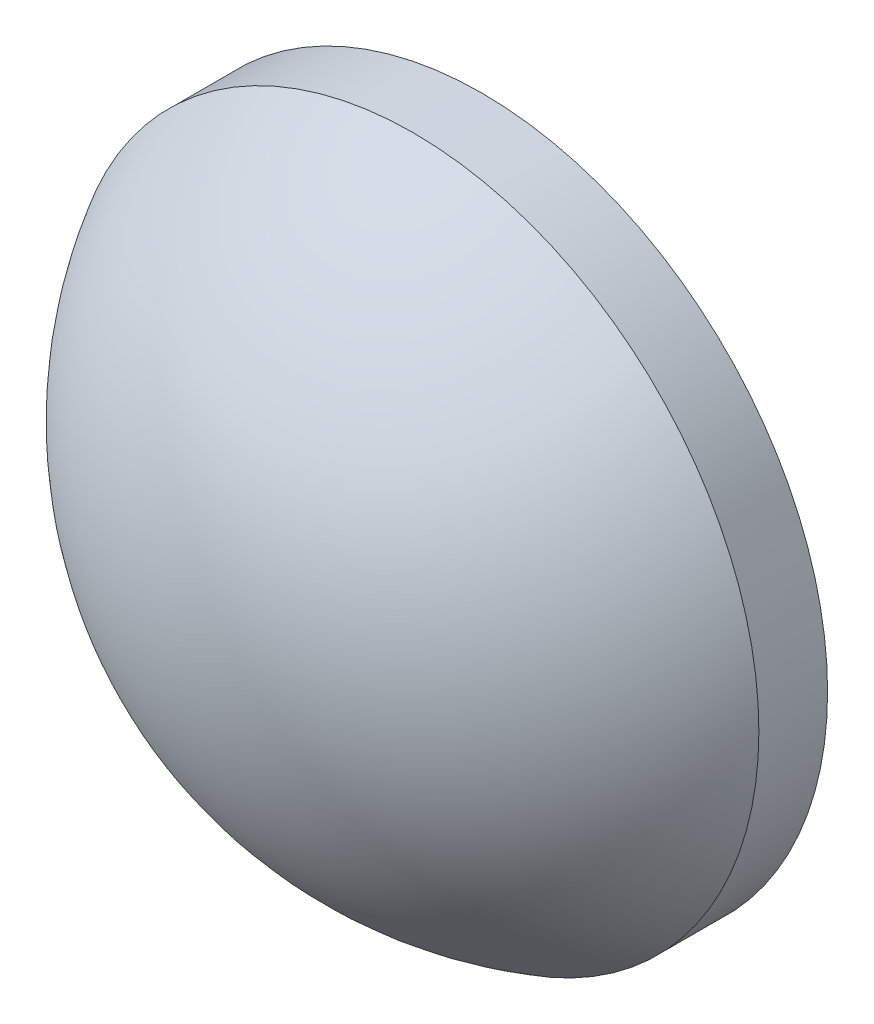
ISO-10303-21;
HEADER;
FILE_DESCRIPTION(('STEP AP214'),'2;1');
FILE_NAME('part.step','',(''),(''),'','','');
FILE_SCHEMA(('AUTOMOTIVE_DESIGN { 1 0 10303 214 1 1 1 1 }'));
ENDSEC;
DATA;
#1=APPLICATION_CONTEXT('core data for automotive mechanical design processes');
#2=APPLICATION_PROTOCOL_DEFINITION('international standard','automotive_design',2000,#1);
#3=PRODUCT_CONTEXT('',#1,'mechanical');
#4=PRODUCT('Part','Part','',(#3));
#5=PRODUCT_RELATED_PRODUCT_CATEGORY('part','',(#4));
#6=PRODUCT_DEFINITION_FORMATION('','',#4);
#7=PRODUCT_DEFINITION_CONTEXT('part definition',#1,'design');
#8=PRODUCT_DEFINITION('design','',#6,#7);
#9=PRODUCT_DEFINITION_SHAPE('','',#8);
#10=(LENGTH_UNIT() NAMED_UNIT(*) SI_UNIT(.MILLI.,.METRE.));
#11=(NAMED_UNIT(*) PLANE_ANGLE_UNIT() SI_UNIT($,.RADIAN.));
#12=(NAMED_UNIT(*) SI_UNIT($,.STERADIAN.) SOLID_ANGLE_UNIT());
#13=UNCERTAINTY_MEASURE_WITH_UNIT(LENGTH_MEASURE(1.E-05),#10,'distance_accuracy_value','');
#14=(GEOMETRIC_REPRESENTATION_CONTEXT(3) GLOBAL_UNCERTAINTY_ASSIGNED_CONTEXT((#13)) GLOBAL_UNIT_ASSIGNED_CONTEXT((#10,
#11,#12)) REPRESENTATION_CONTEXT('',''));
#15=CARTESIAN_POINT('',(0.,0.,0.));
#16=DIRECTION('',(0.,0.,1.));
#17=DIRECTION('',(1.,0.,0.));
#18=AXIS2_PLACEMENT_3D('',#15,#16,#17);
#19=CARTESIAN_POINT('',(0.,0.,-6.76));
#20=DIRECTION('',(0.,0.,1.));
#21=DIRECTION('',(0.,1.,0.));
#22=AXIS2_PLACEMENT_3D('',#19,#20,#21);
#23=SPHERICAL_SURFACE('',#22,10.3);
#24=CARTESIAN_POINT('',(0.,0.,-1.75100808545273));
#25=DIRECTION('',(0.,0.,1.));
#26=DIRECTION('',(1.,0.,0.));
#27=AXIS2_PLACEMENT_3D('',#24,#25,#26);
#28=CIRCLE('',#27,9.);
#29=CARTESIAN_POINT('',(9.,0.,-1.75100808545273));
#30=VERTEX_POINT('',#29);
#31=EDGE_CURVE('E8',#30,#30,#28,.T.);
#32=ORIENTED_EDGE('',*,*,#31,.T.);
#33=EDGE_LOOP('',(#32));
#34=FACE_BOUND('',#33,.T.);
#35=ADVANCED_FACE('F12',(#34),#23,.T.);
#36=CARTESIAN_POINT('',(0.,0.,4.30813204540037));
#37=DIRECTION('',(0.,0.,1.));
#38=DIRECTION('',(1.,0.,0.));
#39=AXIS2_PLACEMENT_3D('',#36,#37,#38);
#40=CYLINDRICAL_SURFACE('',#39,9.);
#41=ORIENTED_EDGE('',*,*,#31,.F.);
#42=EDGE_LOOP('',(#41));
#43=FACE_BOUND('',#42,.T.);
#44=CARTESIAN_POINT('',(0.,0.,-3.54));
#45=DIRECTION('',(0.,0.,1.));
#46=DIRECTION('',(1.,0.,0.));
#47=AXIS2_PLACEMENT_3D('',#44,#45,#46);
#48=CIRCLE('',#47,9.);
#49=CARTESIAN_POINT('',(9.,0.,-3.54));
#50=VERTEX_POINT('',#49);
#51=EDGE_CURVE('E18',#50,#50,#48,.T.);
#52=ORIENTED_EDGE('',*,*,#51,.T.);
#53=EDGE_LOOP('',(#52));
#54=FACE_BOUND('',#53,.T.);
#55=ADVANCED_FACE('F24',(#43,#54),#40,.T.);
#56=CARTESIAN_POINT('',(0.,0.,-3.54));
#57=DIRECTION('',(0.,0.,1.));
#58=DIRECTION('',(1.,0.,0.));
#59=AXIS2_PLACEMENT_3D('',#56,#57,#58);
#60=PLANE('',#59);
#61=ORIENTED_EDGE('',*,*,#51,.F.);
#62=EDGE_LOOP('',(#61));
#63=FACE_BOUND('',#62,.T.);
#64=ADVANCED_FACE('F26',(#63),#60,.F.);
#65=CLOSED_SHELL('',(#35,#55,#64));
#66=MANIFOLD_SOLID_BREP('B1',#65);
#67=ADVANCED_BREP_SHAPE_REPRESENTATION('',(#18,#66),#14);
#68=SHAPE_DEFINITION_REPRESENTATION(#9,#67);
ENDSEC;
END-ISO-10303-21;
